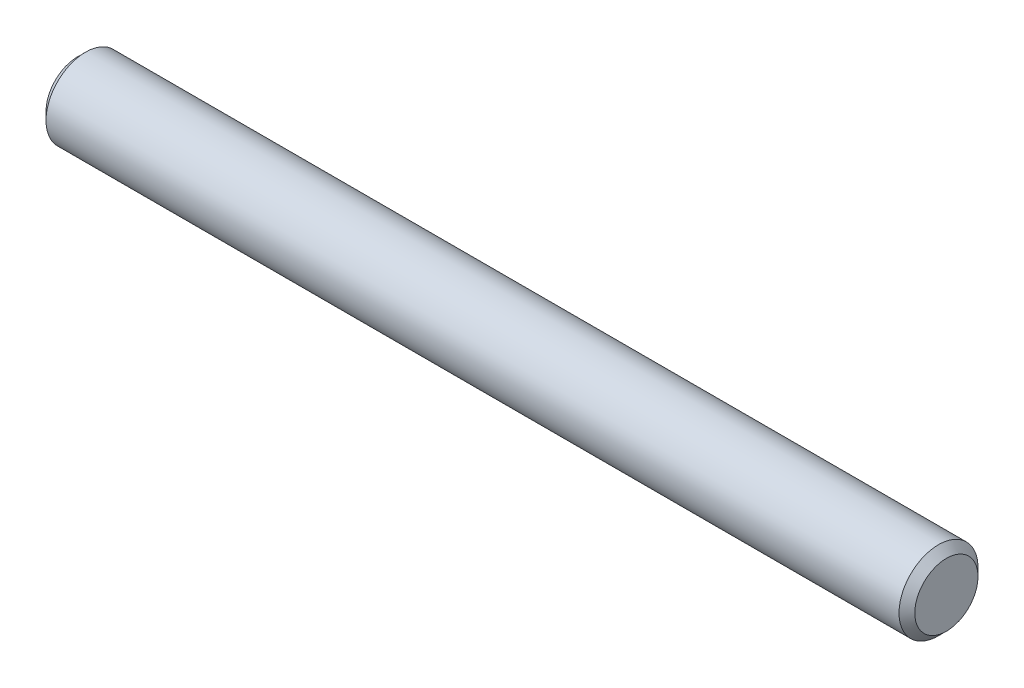
ISO-10303-21;
HEADER;
FILE_DESCRIPTION(('STEP AP214'),'2;1');
FILE_NAME('part.step','',(''),(''),'','','');
FILE_SCHEMA(('AUTOMOTIVE_DESIGN { 1 0 10303 214 1 1 1 1 }'));
ENDSEC;
DATA;
#1=APPLICATION_CONTEXT('core data for automotive mechanical design processes');
#2=APPLICATION_PROTOCOL_DEFINITION('international standard','automotive_design',2000,#1);
#3=PRODUCT_CONTEXT('',#1,'mechanical');
#4=PRODUCT('Part','Part','',(#3));
#5=PRODUCT_RELATED_PRODUCT_CATEGORY('part','',(#4));
#6=PRODUCT_DEFINITION_FORMATION('','',#4);
#7=PRODUCT_DEFINITION_CONTEXT('part definition',#1,'design');
#8=PRODUCT_DEFINITION('design','',#6,#7);
#9=PRODUCT_DEFINITION_SHAPE('','',#8);
#10=(LENGTH_UNIT() NAMED_UNIT(*) SI_UNIT(.MILLI.,.METRE.));
#11=(NAMED_UNIT(*) PLANE_ANGLE_UNIT() SI_UNIT($,.RADIAN.));
#12=(NAMED_UNIT(*) SI_UNIT($,.STERADIAN.) SOLID_ANGLE_UNIT());
#13=UNCERTAINTY_MEASURE_WITH_UNIT(LENGTH_MEASURE(1.E-05),#10,'distance_accuracy_value','');
#14=(GEOMETRIC_REPRESENTATION_CONTEXT(3) GLOBAL_UNCERTAINTY_ASSIGNED_CONTEXT((#13)) GLOBAL_UNIT_ASSIGNED_CONTEXT((#10,
#11,#12)) REPRESENTATION_CONTEXT('',''));
#15=CARTESIAN_POINT('',(0.,0.,0.));
#16=DIRECTION('',(0.,0.,1.));
#17=DIRECTION('',(1.,0.,0.));
#18=AXIS2_PLACEMENT_3D('',#15,#16,#17);
#19=CARTESIAN_POINT('',(11.,0.,0.));
#20=DIRECTION('',(1.,0.,0.));
#21=DIRECTION('',(0.,0.,-1.));
#22=AXIS2_PLACEMENT_3D('',#19,#20,#21);
#23=PLANE('',#22);
#24=CARTESIAN_POINT('',(10.9999999999673,0.,0.));
#25=DIRECTION('',(-1.,0.,0.));
#26=DIRECTION('',(0.,0.,1.));
#27=AXIS2_PLACEMENT_3D('',#24,#25,#26);
#28=CIRCLE('',#27,0.800000000026557);
#29=CARTESIAN_POINT('',(10.9999999999673,0.,0.800000000026557));
#30=VERTEX_POINT('',#29);
#31=EDGE_CURVE('E25',#30,#30,#28,.T.);
#32=ORIENTED_EDGE('',*,*,#31,.F.);
#33=EDGE_LOOP('',(#32));
#34=FACE_BOUND('',#33,.T.);
#35=ADVANCED_FACE('F22',(#34),#23,.T.);
#36=CARTESIAN_POINT('',(-11.,0.,0.));
#37=DIRECTION('',(-1.,0.,0.));
#38=DIRECTION('',(0.,0.,1.));
#39=AXIS2_PLACEMENT_3D('',#36,#37,#38);
#40=PLANE('',#39);
#41=CARTESIAN_POINT('',(-10.9999999999673,0.,0.));
#42=DIRECTION('',(1.,0.,0.));
#43=DIRECTION('',(0.,0.,-1.));
#44=AXIS2_PLACEMENT_3D('',#41,#42,#43);
#45=CIRCLE('',#44,0.800000000026557);
#46=CARTESIAN_POINT('',(-10.9999999999673,0.,-0.800000000026557));
#47=VERTEX_POINT('',#46);
#48=EDGE_CURVE('E34',#47,#47,#45,.T.);
#49=ORIENTED_EDGE('',*,*,#48,.F.);
#50=EDGE_LOOP('',(#49));
#51=FACE_BOUND('',#50,.T.);
#52=ADVANCED_FACE('F45',(#51),#40,.T.);
#53=CARTESIAN_POINT('',(10.8000000001311,0.,0.));
#54=DIRECTION('',(-1.,0.,0.));
#55=DIRECTION('',(0.,0.,1.));
#56=AXIS2_PLACEMENT_3D('',#53,#54,#55);
#57=CONICAL_SURFACE('',#56,0.999999999862666,0.785398163397448);
#58=CARTESIAN_POINT('',(10.8,0.,0.));
#59=DIRECTION('',(-1.,0.,0.));
#60=DIRECTION('',(0.,0.,1.));
#61=AXIS2_PLACEMENT_3D('',#58,#59,#60);
#62=CIRCLE('',#61,1.);
#63=CARTESIAN_POINT('',(10.8,0.,1.));
#64=VERTEX_POINT('',#63);
#65=EDGE_CURVE('E29',#64,#64,#62,.T.);
#66=ORIENTED_EDGE('',*,*,#65,.F.);
#67=EDGE_LOOP('',(#66));
#68=FACE_BOUND('',#67,.T.);
#69=ORIENTED_EDGE('',*,*,#31,.T.);
#70=EDGE_LOOP('',(#69));
#71=FACE_BOUND('',#70,.T.);
#72=ADVANCED_FACE('F42',(#68,#71),#57,.T.);
#73=CARTESIAN_POINT('',(-10.8000000001311,0.,0.));
#74=DIRECTION('',(1.,0.,0.));
#75=DIRECTION('',(0.,0.,-1.));
#76=AXIS2_PLACEMENT_3D('',#73,#74,#75);
#77=CONICAL_SURFACE('',#76,0.999999999862666,0.785398163397448);
#78=CARTESIAN_POINT('',(-10.8,0.,0.));
#79=DIRECTION('',(-1.,0.,0.));
#80=DIRECTION('',(0.,0.,1.));
#81=AXIS2_PLACEMENT_3D('',#78,#79,#80);
#82=CIRCLE('',#81,1.);
#83=CARTESIAN_POINT('',(-10.8,0.,1.));
#84=VERTEX_POINT('',#83);
#85=EDGE_CURVE('E12',#84,#84,#82,.F.);
#86=ORIENTED_EDGE('',*,*,#85,.F.);
#87=EDGE_LOOP('',(#86));
#88=FACE_BOUND('',#87,.T.);
#89=ORIENTED_EDGE('',*,*,#48,.T.);
#90=EDGE_LOOP('',(#89));
#91=FACE_BOUND('',#90,.T.);
#92=ADVANCED_FACE('F53',(#88,#91),#77,.T.);
#93=CARTESIAN_POINT('',(-8.3,0.,0.));
#94=DIRECTION('',(-1.,0.,0.));
#95=DIRECTION('',(0.,0.,1.));
#96=AXIS2_PLACEMENT_3D('',#93,#94,#95);
#97=CYLINDRICAL_SURFACE('',#96,1.);
#98=ORIENTED_EDGE('',*,*,#85,.T.);
#99=EDGE_LOOP('',(#98));
#100=FACE_BOUND('',#99,.T.);
#101=ORIENTED_EDGE('',*,*,#65,.T.);
#102=EDGE_LOOP('',(#101));
#103=FACE_BOUND('',#102,.T.);
#104=ADVANCED_FACE('F51',(#100,#103),#97,.T.);
#105=CLOSED_SHELL('',(#35,#52,#72,#92,#104));
#106=MANIFOLD_SOLID_BREP('B1',#105);
#107=ADVANCED_BREP_SHAPE_REPRESENTATION('',(#18,#106),#14);
#108=SHAPE_DEFINITION_REPRESENTATION(#9,#107);
ENDSEC;
END-ISO-10303-21;
